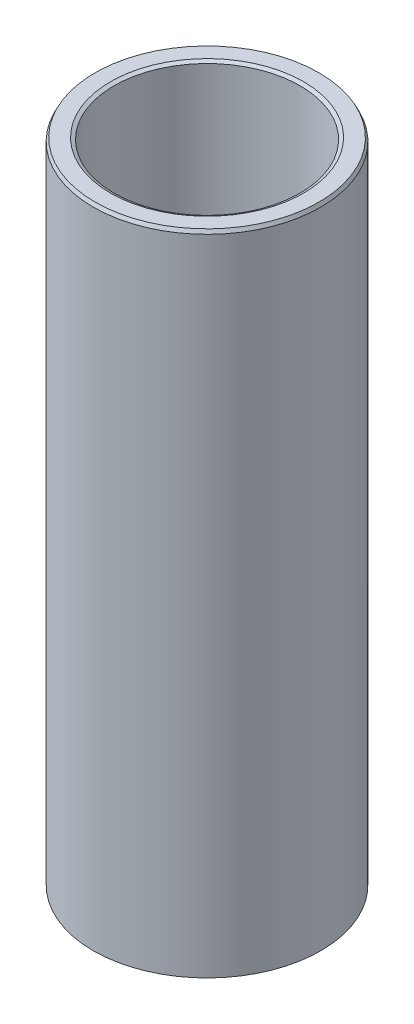
ISO-10303-21;
HEADER;
FILE_DESCRIPTION(('STEP AP214'),'2;1');
FILE_NAME('part.step','',(''),(''),'','','');
FILE_SCHEMA(('AUTOMOTIVE_DESIGN { 1 0 10303 214 1 1 1 1 }'));
ENDSEC;
DATA;
#1=APPLICATION_CONTEXT('core data for automotive mechanical design processes');
#2=APPLICATION_PROTOCOL_DEFINITION('international standard','automotive_design',2000,#1);
#3=PRODUCT_CONTEXT('',#1,'mechanical');
#4=PRODUCT('Part','Part','',(#3));
#5=PRODUCT_RELATED_PRODUCT_CATEGORY('part','',(#4));
#6=PRODUCT_DEFINITION_FORMATION('','',#4);
#7=PRODUCT_DEFINITION_CONTEXT('part definition',#1,'design');
#8=PRODUCT_DEFINITION('design','',#6,#7);
#9=PRODUCT_DEFINITION_SHAPE('','',#8);
#10=(LENGTH_UNIT() NAMED_UNIT(*) SI_UNIT(.MILLI.,.METRE.));
#11=(NAMED_UNIT(*) PLANE_ANGLE_UNIT() SI_UNIT($,.RADIAN.));
#12=(NAMED_UNIT(*) SI_UNIT($,.STERADIAN.) SOLID_ANGLE_UNIT());
#13=UNCERTAINTY_MEASURE_WITH_UNIT(LENGTH_MEASURE(1.E-05),#10,'distance_accuracy_value','');
#14=(GEOMETRIC_REPRESENTATION_CONTEXT(3) GLOBAL_UNCERTAINTY_ASSIGNED_CONTEXT((#13)) GLOBAL_UNIT_ASSIGNED_CONTEXT((#10,
#11,#12)) REPRESENTATION_CONTEXT('',''));
#15=CARTESIAN_POINT('',(0.,0.,0.));
#16=DIRECTION('',(0.,0.,1.));
#17=DIRECTION('',(1.,0.,0.));
#18=AXIS2_PLACEMENT_3D('',#15,#16,#17);
#19=CARTESIAN_POINT('',(0.,214.018456133714,0.));
#20=DIRECTION('',(0.,-1.,0.));
#21=DIRECTION('',(0.,0.,-1.));
#22=AXIS2_PLACEMENT_3D('',#19,#20,#21);
#23=CYLINDRICAL_SURFACE('',#22,37.5);
#24=CARTESIAN_POINT('',(0.,0.584453351999165,0.));
#25=DIRECTION('',(0.,1.,0.));
#26=DIRECTION('',(0.,0.,1.));
#27=AXIS2_PLACEMENT_3D('',#24,#25,#26);
#28=CIRCLE('',#27,37.5);
#29=CARTESIAN_POINT('',(0.,0.584453351999165,37.5));
#30=VERTEX_POINT('',#29);
#31=EDGE_CURVE('E10',#30,#30,#28,.T.);
#32=ORIENTED_EDGE('',*,*,#31,.T.);
#33=EDGE_LOOP('',(#32));
#34=FACE_BOUND('',#33,.T.);
#35=CARTESIAN_POINT('',(0.,212.863587496522,0.));
#36=DIRECTION('',(0.,1.,0.));
#37=DIRECTION('',(0.,0.,1.));
#38=AXIS2_PLACEMENT_3D('',#35,#36,#37);
#39=CIRCLE('',#38,37.5);
#40=CARTESIAN_POINT('',(0.,212.863587496522,37.5));
#41=VERTEX_POINT('',#40);
#42=EDGE_CURVE('E50',#41,#41,#39,.F.);
#43=ORIENTED_EDGE('',*,*,#42,.T.);
#44=EDGE_LOOP('',(#43));
#45=FACE_BOUND('',#44,.T.);
#46=ADVANCED_FACE('F39',(#34,#45),#23,.T.);
#47=CARTESIAN_POINT('',(0.,214.018456133714,0.));
#48=DIRECTION('',(0.,1.,0.));
#49=DIRECTION('',(0.,0.,1.));
#50=AXIS2_PLACEMENT_3D('',#47,#48,#49);
#51=PLANE('',#50);
#52=CARTESIAN_POINT('',(0.,214.018456133714,0.));
#53=DIRECTION('',(0.,1.,0.));
#54=DIRECTION('',(0.,0.,1.));
#55=AXIS2_PLACEMENT_3D('',#52,#53,#54);
#56=CIRCLE('',#55,31.824309801609);
#57=CARTESIAN_POINT('',(0.,214.018456133714,31.824309801609));
#58=VERTEX_POINT('',#57);
#59=EDGE_CURVE('E58',#58,#58,#56,.F.);
#60=ORIENTED_EDGE('',*,*,#59,.T.);
#61=EDGE_LOOP('',(#60));
#62=FACE_BOUND('',#61,.T.);
#63=CARTESIAN_POINT('',(0.,214.018456133714,0.));
#64=DIRECTION('',(0.,1.,0.));
#65=DIRECTION('',(0.,0.,1.));
#66=AXIS2_PLACEMENT_3D('',#63,#64,#65);
#67=CIRCLE('',#66,36.9155466480008);
#68=CARTESIAN_POINT('',(0.,214.018456133714,36.9155466480008));
#69=VERTEX_POINT('',#68);
#70=EDGE_CURVE('E61',#69,#69,#67,.T.);
#71=ORIENTED_EDGE('',*,*,#70,.T.);
#72=EDGE_LOOP('',(#71));
#73=FACE_BOUND('',#72,.T.);
#74=ADVANCED_FACE('F88',(#62,#73),#51,.T.);
#75=CARTESIAN_POINT('',(0.,0.,0.));
#76=DIRECTION('',(0.,1.,0.));
#77=DIRECTION('',(0.,0.,1.));
#78=AXIS2_PLACEMENT_3D('',#75,#76,#77);
#79=PLANE('',#78);
#80=CARTESIAN_POINT('',(0.,0.,0.));
#81=DIRECTION('',(0.,1.,0.));
#82=DIRECTION('',(0.,0.,1.));
#83=AXIS2_PLACEMENT_3D('',#80,#81,#82);
#84=CIRCLE('',#83,31.2538945164161);
#85=CARTESIAN_POINT('',(0.,0.,31.2538945164161));
#86=VERTEX_POINT('',#85);
#87=EDGE_CURVE('E51',#86,#86,#84,.T.);
#88=ORIENTED_EDGE('',*,*,#87,.T.);
#89=EDGE_LOOP('',(#88));
#90=FACE_BOUND('',#89,.T.);
#91=CARTESIAN_POINT('',(0.,0.,0.));
#92=DIRECTION('',(0.,1.,0.));
#93=DIRECTION('',(0.,0.,1.));
#94=AXIS2_PLACEMENT_3D('',#91,#92,#93);
#95=CIRCLE('',#94,36.345131362808);
#96=CARTESIAN_POINT('',(0.,0.,36.345131362808));
#97=VERTEX_POINT('',#96);
#98=EDGE_CURVE('E54',#97,#97,#95,.F.);
#99=ORIENTED_EDGE('',*,*,#98,.T.);
#100=EDGE_LOOP('',(#99));
#101=FACE_BOUND('',#100,.T.);
#102=ADVANCED_FACE('F83',(#90,#101),#79,.F.);
#103=CARTESIAN_POINT('',(0.,214.018456133714,0.));
#104=DIRECTION('',(0.,-1.,0.));
#105=DIRECTION('',(0.,0.,-1.));
#106=AXIS2_PLACEMENT_3D('',#103,#104,#105);
#107=CYLINDRICAL_SURFACE('',#106,30.669441164417);
#108=CARTESIAN_POINT('',(0.,213.434002781715,0.));
#109=DIRECTION('',(0.,1.,0.));
#110=DIRECTION('',(0.,0.,1.));
#111=AXIS2_PLACEMENT_3D('',#108,#109,#110);
#112=CIRCLE('',#111,30.669441164417);
#113=CARTESIAN_POINT('',(0.,213.434002781715,30.669441164417));
#114=VERTEX_POINT('',#113);
#115=EDGE_CURVE('E67',#114,#114,#112,.T.);
#116=ORIENTED_EDGE('',*,*,#115,.T.);
#117=EDGE_LOOP('',(#116));
#118=FACE_BOUND('',#117,.T.);
#119=CARTESIAN_POINT('',(0.,1.15486863719202,0.));
#120=DIRECTION('',(0.,1.,0.));
#121=DIRECTION('',(0.,0.,1.));
#122=AXIS2_PLACEMENT_3D('',#119,#120,#121);
#123=CIRCLE('',#122,30.669441164417);
#124=CARTESIAN_POINT('',(0.,1.15486863719202,30.669441164417));
#125=VERTEX_POINT('',#124);
#126=EDGE_CURVE('E69',#125,#125,#123,.F.);
#127=ORIENTED_EDGE('',*,*,#126,.T.);
#128=EDGE_LOOP('',(#127));
#129=FACE_BOUND('',#128,.T.);
#130=ADVANCED_FACE('F71',(#118,#129),#107,.F.);
#131=CARTESIAN_POINT('',(0.,213.434002781715,0.));
#132=DIRECTION('',(0.,1.,0.));
#133=DIRECTION('',(0.,0.,1.));
#134=AXIS2_PLACEMENT_3D('',#131,#132,#133);
#135=CONICAL_SURFACE('',#134,30.669441164417,1.10229832660344);
#136=ORIENTED_EDGE('',*,*,#59,.F.);
#137=EDGE_LOOP('',(#136));
#138=FACE_BOUND('',#137,.T.);
#139=ORIENTED_EDGE('',*,*,#115,.F.);
#140=EDGE_LOOP('',(#139));
#141=FACE_BOUND('',#140,.T.);
#142=ADVANCED_FACE('F77',(#138,#141),#135,.F.);
#143=CARTESIAN_POINT('',(0.,0.,0.));
#144=DIRECTION('',(0.,-1.,0.));
#145=DIRECTION('',(0.,0.,-1.));
#146=AXIS2_PLACEMENT_3D('',#143,#144,#145);
#147=CONICAL_SURFACE('',#146,31.2538945164161,0.468498000191433);
#148=ORIENTED_EDGE('',*,*,#126,.F.);
#149=EDGE_LOOP('',(#148));
#150=FACE_BOUND('',#149,.T.);
#151=ORIENTED_EDGE('',*,*,#87,.F.);
#152=EDGE_LOOP('',(#151));
#153=FACE_BOUND('',#152,.T.);
#154=ADVANCED_FACE('F73',(#150,#153),#147,.F.);
#155=CARTESIAN_POINT('',(0.,0.584453351999165,0.));
#156=DIRECTION('',(0.,1.,0.));
#157=DIRECTION('',(0.,0.,1.));
#158=AXIS2_PLACEMENT_3D('',#155,#156,#157);
#159=CONICAL_SURFACE('',#158,37.5,1.10229832660346);
#160=ORIENTED_EDGE('',*,*,#98,.F.);
#161=EDGE_LOOP('',(#160));
#162=FACE_BOUND('',#161,.T.);
#163=ORIENTED_EDGE('',*,*,#31,.F.);
#164=EDGE_LOOP('',(#163));
#165=FACE_BOUND('',#164,.T.);
#166=ADVANCED_FACE('F76',(#162,#165),#159,.T.);
#167=CARTESIAN_POINT('',(0.,214.018456133714,0.));
#168=DIRECTION('',(0.,-1.,0.));
#169=DIRECTION('',(0.,0.,-1.));
#170=AXIS2_PLACEMENT_3D('',#167,#168,#169);
#171=CONICAL_SURFACE('',#170,36.9155466480008,0.468498000191423);
#172=ORIENTED_EDGE('',*,*,#42,.F.);
#173=EDGE_LOOP('',(#172));
#174=FACE_BOUND('',#173,.T.);
#175=ORIENTED_EDGE('',*,*,#70,.F.);
#176=EDGE_LOOP('',(#175));
#177=FACE_BOUND('',#176,.T.);
#178=ADVANCED_FACE('F45',(#174,#177),#171,.T.);
#179=CLOSED_SHELL('',(#46,#74,#102,#130,#142,#154,#166,#178));
#180=MANIFOLD_SOLID_BREP('B2',#179);
#181=ADVANCED_BREP_SHAPE_REPRESENTATION('',(#18,#180),#14);
#182=SHAPE_DEFINITION_REPRESENTATION(#9,#181);
ENDSEC;
END-ISO-10303-21;
